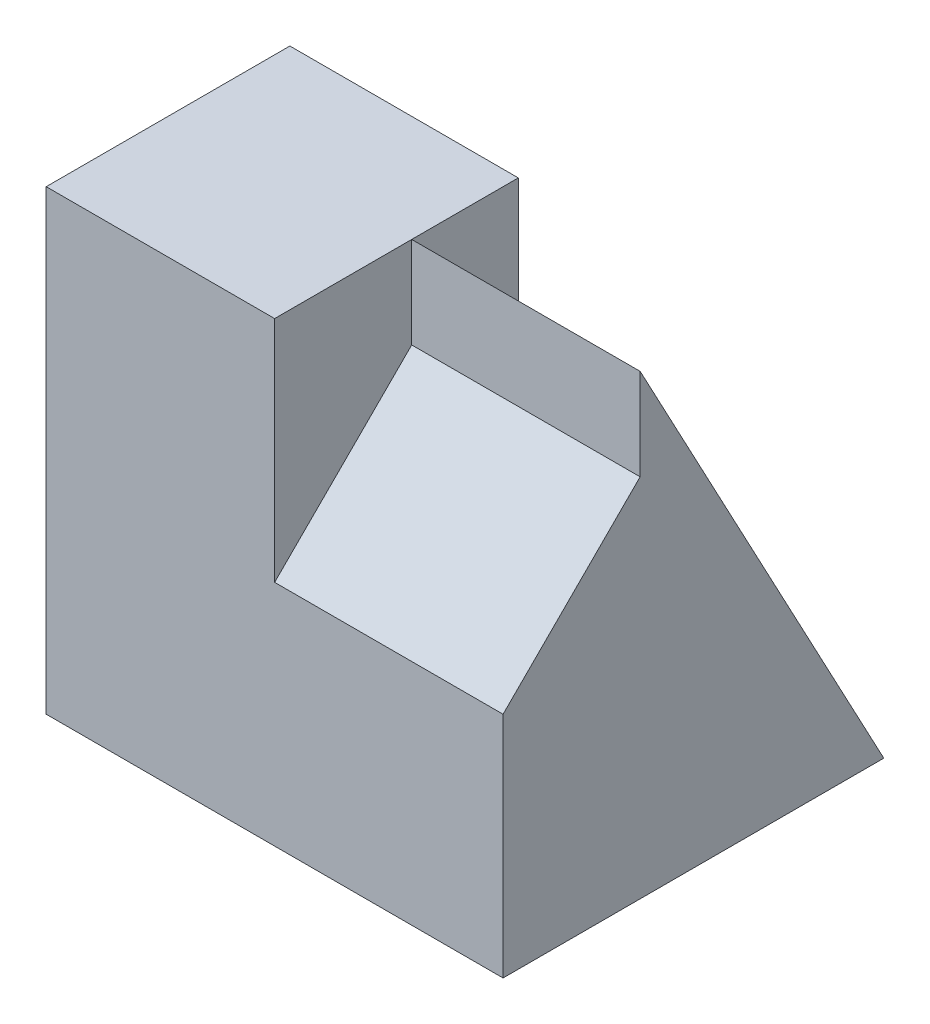
ISO-10303-21;
HEADER;
FILE_DESCRIPTION(('STEP AP214'),'2;1');
FILE_NAME('part.step','',(''),(''),'','','');
FILE_SCHEMA(('AUTOMOTIVE_DESIGN { 1 0 10303 214 1 1 1 1 }'));
ENDSEC;
DATA;
#1=APPLICATION_CONTEXT('core data for automotive mechanical design processes');
#2=APPLICATION_PROTOCOL_DEFINITION('international standard','automotive_design',2000,#1);
#3=PRODUCT_CONTEXT('',#1,'mechanical');
#4=PRODUCT('Part','Part','',(#3));
#5=PRODUCT_RELATED_PRODUCT_CATEGORY('part','',(#4));
#6=PRODUCT_DEFINITION_FORMATION('','',#4);
#7=PRODUCT_DEFINITION_CONTEXT('part definition',#1,'design');
#8=PRODUCT_DEFINITION('design','',#6,#7);
#9=PRODUCT_DEFINITION_SHAPE('','',#8);
#10=(LENGTH_UNIT() NAMED_UNIT(*) SI_UNIT(.MILLI.,.METRE.));
#11=(NAMED_UNIT(*) PLANE_ANGLE_UNIT() SI_UNIT($,.RADIAN.));
#12=(NAMED_UNIT(*) SI_UNIT($,.STERADIAN.) SOLID_ANGLE_UNIT());
#13=UNCERTAINTY_MEASURE_WITH_UNIT(LENGTH_MEASURE(1.E-05),#10,'distance_accuracy_value','');
#14=(GEOMETRIC_REPRESENTATION_CONTEXT(3) GLOBAL_UNCERTAINTY_ASSIGNED_CONTEXT((#13)) GLOBAL_UNIT_ASSIGNED_CONTEXT((#10,
#11,#12)) REPRESENTATION_CONTEXT('',''));
#15=CARTESIAN_POINT('',(0.,0.,0.));
#16=DIRECTION('',(0.,0.,1.));
#17=DIRECTION('',(1.,0.,0.));
#18=AXIS2_PLACEMENT_3D('',#15,#16,#17);
#19=CARTESIAN_POINT('',(-3.,6.,-3.2));
#20=DIRECTION('',(0.,0.,1.));
#21=DIRECTION('',(0.,-1.,0.));
#22=AXIS2_PLACEMENT_3D('',#19,#20,#21);
#23=PLANE('',#22);
#24=DIRECTION('',(1.,0.,0.));
#25=VECTOR('',#24,1.);
#26=CARTESIAN_POINT('',(-3.,3.375,-3.2));
#27=LINE('',#26,#25);
#28=CARTESIAN_POINT('',(-3.,3.375,-3.2));
#29=VERTEX_POINT('',#28);
#30=CARTESIAN_POINT('',(0.,3.375,-3.2));
#31=VERTEX_POINT('',#30);
#32=EDGE_CURVE('E128',#29,#31,#27,.T.);
#33=ORIENTED_EDGE('',*,*,#32,.F.);
#34=DIRECTION('',(0.,-1.,0.));
#35=VECTOR('',#34,1.);
#36=CARTESIAN_POINT('',(-3.,6.,-3.2));
#37=LINE('',#36,#35);
#38=CARTESIAN_POINT('',(-3.,6.,-3.2));
#39=VERTEX_POINT('',#38);
#40=EDGE_CURVE('E154',#39,#29,#37,.T.);
#41=ORIENTED_EDGE('',*,*,#40,.F.);
#42=DIRECTION('',(1.,0.,0.));
#43=VECTOR('',#42,1.);
#44=CARTESIAN_POINT('',(-3.,6.,-3.2));
#45=LINE('',#44,#43);
#46=CARTESIAN_POINT('',(0.,6.,-3.2));
#47=VERTEX_POINT('',#46);
#48=EDGE_CURVE('E147',#39,#47,#45,.T.);
#49=ORIENTED_EDGE('',*,*,#48,.T.);
#50=DIRECTION('',(0.,-1.,0.));
#51=VECTOR('',#50,1.);
#52=CARTESIAN_POINT('',(0.,6.,-3.2));
#53=LINE('',#52,#51);
#54=EDGE_CURVE('E144',#47,#31,#53,.T.);
#55=ORIENTED_EDGE('',*,*,#54,.T.);
#56=EDGE_LOOP('',(#33,#41,#49,#55));
#57=FACE_BOUND('',#56,.T.);
#58=ADVANCED_FACE('F33',(#57),#23,.F.);
#59=CARTESIAN_POINT('',(3.,0.,-5.));
#60=DIRECTION('',(0.,1.,0.));
#61=DIRECTION('',(0.,0.,1.));
#62=AXIS2_PLACEMENT_3D('',#59,#60,#61);
#63=PLANE('',#62);
#64=DIRECTION('',(0.,0.,1.));
#65=VECTOR('',#64,1.);
#66=CARTESIAN_POINT('',(-3.,0.,0.));
#67=LINE('',#66,#65);
#68=CARTESIAN_POINT('',(-3.,0.,-5.));
#69=VERTEX_POINT('',#68);
#70=CARTESIAN_POINT('',(-3.,0.,0.));
#71=VERTEX_POINT('',#70);
#72=EDGE_CURVE('E141',#69,#71,#67,.T.);
#73=ORIENTED_EDGE('',*,*,#72,.F.);
#74=DIRECTION('',(-1.,0.,0.));
#75=VECTOR('',#74,1.);
#76=CARTESIAN_POINT('',(3.,0.,-5.));
#77=LINE('',#76,#75);
#78=CARTESIAN_POINT('',(3.,0.,-5.));
#79=VERTEX_POINT('',#78);
#80=EDGE_CURVE('E11',#79,#69,#77,.T.);
#81=ORIENTED_EDGE('',*,*,#80,.F.);
#82=DIRECTION('',(0.,0.,-1.));
#83=VECTOR('',#82,1.);
#84=CARTESIAN_POINT('',(3.,0.,-5.));
#85=LINE('',#84,#83);
#86=CARTESIAN_POINT('',(3.,0.,0.));
#87=VERTEX_POINT('',#86);
#88=EDGE_CURVE('E112',#87,#79,#85,.T.);
#89=ORIENTED_EDGE('',*,*,#88,.F.);
#90=DIRECTION('',(-1.,0.,0.));
#91=VECTOR('',#90,1.);
#92=CARTESIAN_POINT('',(3.,0.,0.));
#93=LINE('',#92,#91);
#94=EDGE_CURVE('E100',#87,#71,#93,.T.);
#95=ORIENTED_EDGE('',*,*,#94,.T.);
#96=EDGE_LOOP('',(#73,#81,#89,#95));
#97=FACE_BOUND('',#96,.T.);
#98=ADVANCED_FACE('F35',(#97),#63,.F.);
#99=CARTESIAN_POINT('',(3.,6.,-1.8));
#100=DIRECTION('',(0.,-0.470588235294118,0.88235294117647));
#101=DIRECTION('',(0.,-0.882352941176471,-0.470588235294118));
#102=AXIS2_PLACEMENT_3D('',#99,#100,#101);
#103=PLANE('',#102);
#104=ORIENTED_EDGE('',*,*,#80,.T.);
#105=DIRECTION('',(0.,-0.882352941176471,-0.470588235294118));
#106=VECTOR('',#105,1.);
#107=CARTESIAN_POINT('',(-3.,3.375,-3.2));
#108=LINE('',#107,#106);
#109=EDGE_CURVE('E133',#29,#69,#108,.T.);
#110=ORIENTED_EDGE('',*,*,#109,.F.);
#111=ORIENTED_EDGE('',*,*,#32,.T.);
#112=DIRECTION('',(0.,0.882352941176471,0.470588235294118));
#113=VECTOR('',#112,1.);
#114=CARTESIAN_POINT('',(0.,6.,-1.8));
#115=LINE('',#114,#113);
#116=CARTESIAN_POINT('',(0.,6.,-1.8));
#117=VERTEX_POINT('',#116);
#118=EDGE_CURVE('E104',#31,#117,#115,.T.);
#119=ORIENTED_EDGE('',*,*,#118,.T.);
#120=DIRECTION('',(-1.,0.,0.));
#121=VECTOR('',#120,1.);
#122=CARTESIAN_POINT('',(3.,6.,-1.8));
#123=LINE('',#122,#121);
#124=CARTESIAN_POINT('',(3.,6.,-1.8));
#125=VERTEX_POINT('',#124);
#126=EDGE_CURVE('E43',#125,#117,#123,.T.);
#127=ORIENTED_EDGE('',*,*,#126,.F.);
#128=DIRECTION('',(0.,0.882352941176471,0.470588235294118));
#129=VECTOR('',#128,1.);
#130=CARTESIAN_POINT('',(3.,6.,-1.8));
#131=LINE('',#130,#129);
#132=EDGE_CURVE('E82',#79,#125,#131,.T.);
#133=ORIENTED_EDGE('',*,*,#132,.F.);
#134=EDGE_LOOP('',(#104,#110,#111,#119,#127,#133));
#135=FACE_BOUND('',#134,.T.);
#136=ADVANCED_FACE('F173',(#135),#103,.F.);
#137=CARTESIAN_POINT('',(3.,4.8,-1.8));
#138=DIRECTION('',(0.,0.,-1.));
#139=DIRECTION('',(-1.,0.,0.));
#140=AXIS2_PLACEMENT_3D('',#137,#138,#139);
#141=PLANE('',#140);
#142=DIRECTION('',(0.,-1.,0.));
#143=VECTOR('',#142,1.);
#144=CARTESIAN_POINT('',(0.,4.8,-1.8));
#145=LINE('',#144,#143);
#146=CARTESIAN_POINT('',(0.,4.8,-1.8));
#147=VERTEX_POINT('',#146);
#148=EDGE_CURVE('E67',#117,#147,#145,.T.);
#149=ORIENTED_EDGE('',*,*,#148,.T.);
#150=DIRECTION('',(-1.,0.,0.));
#151=VECTOR('',#150,1.);
#152=CARTESIAN_POINT('',(3.,4.8,-1.8));
#153=LINE('',#152,#151);
#154=CARTESIAN_POINT('',(3.,4.8,-1.8));
#155=VERTEX_POINT('',#154);
#156=EDGE_CURVE('E94',#155,#147,#153,.T.);
#157=ORIENTED_EDGE('',*,*,#156,.F.);
#158=DIRECTION('',(0.,-1.,0.));
#159=VECTOR('',#158,1.);
#160=CARTESIAN_POINT('',(3.,4.8,-1.8));
#161=LINE('',#160,#159);
#162=EDGE_CURVE('E89',#125,#155,#161,.T.);
#163=ORIENTED_EDGE('',*,*,#162,.F.);
#164=ORIENTED_EDGE('',*,*,#126,.T.);
#165=EDGE_LOOP('',(#149,#157,#163,#164));
#166=FACE_BOUND('',#165,.T.);
#167=ADVANCED_FACE('F95',(#166),#141,.F.);
#168=CARTESIAN_POINT('',(3.,3.,0.));
#169=DIRECTION('',(0.,-0.707106781186547,-0.707106781186548));
#170=DIRECTION('',(0.,0.707106781186548,-0.707106781186547));
#171=AXIS2_PLACEMENT_3D('',#168,#169,#170);
#172=PLANE('',#171);
#173=DIRECTION('',(0.,-0.707106781186548,0.707106781186547));
#174=VECTOR('',#173,1.);
#175=CARTESIAN_POINT('',(0.,3.,0.));
#176=LINE('',#175,#174);
#177=CARTESIAN_POINT('',(0.,3.,0.));
#178=VERTEX_POINT('',#177);
#179=EDGE_CURVE('E74',#147,#178,#176,.T.);
#180=ORIENTED_EDGE('',*,*,#179,.T.);
#181=DIRECTION('',(-1.,0.,0.));
#182=VECTOR('',#181,1.);
#183=CARTESIAN_POINT('',(3.,3.,0.));
#184=LINE('',#183,#182);
#185=CARTESIAN_POINT('',(3.,3.,0.));
#186=VERTEX_POINT('',#185);
#187=EDGE_CURVE('E96',#186,#178,#184,.T.);
#188=ORIENTED_EDGE('',*,*,#187,.F.);
#189=DIRECTION('',(0.,-0.707106781186548,0.707106781186547));
#190=VECTOR('',#189,1.);
#191=CARTESIAN_POINT('',(3.,3.,0.));
#192=LINE('',#191,#190);
#193=EDGE_CURVE('E92',#155,#186,#192,.T.);
#194=ORIENTED_EDGE('',*,*,#193,.F.);
#195=ORIENTED_EDGE('',*,*,#156,.T.);
#196=EDGE_LOOP('',(#180,#188,#194,#195));
#197=FACE_BOUND('',#196,.T.);
#198=ADVANCED_FACE('F98',(#197),#172,.F.);
#199=CARTESIAN_POINT('',(3.,0.,0.));
#200=DIRECTION('',(0.,0.,-1.));
#201=DIRECTION('',(-1.,0.,0.));
#202=AXIS2_PLACEMENT_3D('',#199,#200,#201);
#203=PLANE('',#202);
#204=ORIENTED_EDGE('',*,*,#187,.T.);
#205=DIRECTION('',(0.,1.,0.));
#206=VECTOR('',#205,1.);
#207=CARTESIAN_POINT('',(0.,6.,0.));
#208=LINE('',#207,#206);
#209=CARTESIAN_POINT('',(0.,6.,0.));
#210=VERTEX_POINT('',#209);
#211=EDGE_CURVE('E120',#178,#210,#208,.T.);
#212=ORIENTED_EDGE('',*,*,#211,.T.);
#213=DIRECTION('',(1.,0.,0.));
#214=VECTOR('',#213,1.);
#215=CARTESIAN_POINT('',(-3.,6.,0.));
#216=LINE('',#215,#214);
#217=CARTESIAN_POINT('',(-3.,6.,0.));
#218=VERTEX_POINT('',#217);
#219=EDGE_CURVE('E106',#218,#210,#216,.T.);
#220=ORIENTED_EDGE('',*,*,#219,.F.);
#221=DIRECTION('',(0.,1.,0.));
#222=VECTOR('',#221,1.);
#223=CARTESIAN_POINT('',(-3.,6.,0.));
#224=LINE('',#223,#222);
#225=EDGE_CURVE('E146',#71,#218,#224,.T.);
#226=ORIENTED_EDGE('',*,*,#225,.F.);
#227=ORIENTED_EDGE('',*,*,#94,.F.);
#228=DIRECTION('',(0.,-1.,0.));
#229=VECTOR('',#228,1.);
#230=CARTESIAN_POINT('',(3.,0.,0.));
#231=LINE('',#230,#229);
#232=EDGE_CURVE('E52',#186,#87,#231,.T.);
#233=ORIENTED_EDGE('',*,*,#232,.F.);
#234=EDGE_LOOP('',(#204,#212,#220,#226,#227,#233));
#235=FACE_BOUND('',#234,.T.);
#236=ADVANCED_FACE('F117',(#235),#203,.F.);
#237=CARTESIAN_POINT('',(3.,0.,0.));
#238=DIRECTION('',(-1.,0.,0.));
#239=DIRECTION('',(0.,0.,1.));
#240=AXIS2_PLACEMENT_3D('',#237,#238,#239);
#241=PLANE('',#240);
#242=ORIENTED_EDGE('',*,*,#88,.T.);
#243=ORIENTED_EDGE('',*,*,#132,.T.);
#244=ORIENTED_EDGE('',*,*,#162,.T.);
#245=ORIENTED_EDGE('',*,*,#193,.T.);
#246=ORIENTED_EDGE('',*,*,#232,.T.);
#247=EDGE_LOOP('',(#242,#243,#244,#245,#246));
#248=FACE_BOUND('',#247,.T.);
#249=ADVANCED_FACE('F90',(#248),#241,.F.);
#250=CARTESIAN_POINT('',(0.,0.,0.));
#251=DIRECTION('',(1.,0.,0.));
#252=DIRECTION('',(0.,0.,-1.));
#253=AXIS2_PLACEMENT_3D('',#250,#251,#252);
#254=PLANE('',#253);
#255=ORIENTED_EDGE('',*,*,#179,.F.);
#256=ORIENTED_EDGE('',*,*,#148,.F.);
#257=DIRECTION('',(0.,0.,-1.));
#258=VECTOR('',#257,1.);
#259=CARTESIAN_POINT('',(0.,6.,0.));
#260=LINE('',#259,#258);
#261=EDGE_CURVE('E125',#210,#117,#260,.T.);
#262=ORIENTED_EDGE('',*,*,#261,.F.);
#263=ORIENTED_EDGE('',*,*,#211,.F.);
#264=EDGE_LOOP('',(#255,#256,#262,#263));
#265=FACE_BOUND('',#264,.T.);
#266=ADVANCED_FACE('F123',(#265),#254,.T.);
#267=ORIENTED_EDGE('',*,*,#118,.F.);
#268=ORIENTED_EDGE('',*,*,#54,.F.);
#269=EDGE_CURVE('E127',#117,#47,#260,.T.);
#270=ORIENTED_EDGE('',*,*,#269,.F.);
#271=EDGE_LOOP('',(#267,#268,#270));
#272=FACE_BOUND('',#271,.T.);
#273=ADVANCED_FACE('F181',(#272),#254,.T.);
#274=CARTESIAN_POINT('',(-3.,6.,0.));
#275=DIRECTION('',(0.,-1.,0.));
#276=DIRECTION('',(0.,0.,-1.));
#277=AXIS2_PLACEMENT_3D('',#274,#275,#276);
#278=PLANE('',#277);
#279=ORIENTED_EDGE('',*,*,#261,.T.);
#280=ORIENTED_EDGE('',*,*,#269,.T.);
#281=ORIENTED_EDGE('',*,*,#48,.F.);
#282=DIRECTION('',(0.,0.,-1.));
#283=VECTOR('',#282,1.);
#284=CARTESIAN_POINT('',(-3.,6.,0.));
#285=LINE('',#284,#283);
#286=EDGE_CURVE('E161',#218,#39,#285,.T.);
#287=ORIENTED_EDGE('',*,*,#286,.F.);
#288=ORIENTED_EDGE('',*,*,#219,.T.);
#289=EDGE_LOOP('',(#279,#280,#281,#287,#288));
#290=FACE_BOUND('',#289,.T.);
#291=ADVANCED_FACE('F188',(#290),#278,.F.);
#292=CARTESIAN_POINT('',(-3.,0.,0.));
#293=DIRECTION('',(1.,0.,0.));
#294=DIRECTION('',(0.,0.,-1.));
#295=AXIS2_PLACEMENT_3D('',#292,#293,#294);
#296=PLANE('',#295);
#297=ORIENTED_EDGE('',*,*,#225,.T.);
#298=ORIENTED_EDGE('',*,*,#286,.T.);
#299=ORIENTED_EDGE('',*,*,#40,.T.);
#300=ORIENTED_EDGE('',*,*,#109,.T.);
#301=ORIENTED_EDGE('',*,*,#72,.T.);
#302=EDGE_LOOP('',(#297,#298,#299,#300,#301));
#303=FACE_BOUND('',#302,.T.);
#304=ADVANCED_FACE('F169',(#303),#296,.F.);
#305=CLOSED_SHELL('',(#58,#98,#136,#167,#198,#236,#249,#266,#273,#291,#304));
#306=MANIFOLD_SOLID_BREP('B2',#305);
#307=ADVANCED_BREP_SHAPE_REPRESENTATION('',(#18,#306),#14);
#308=SHAPE_DEFINITION_REPRESENTATION(#9,#307);
ENDSEC;
END-ISO-10303-21;
